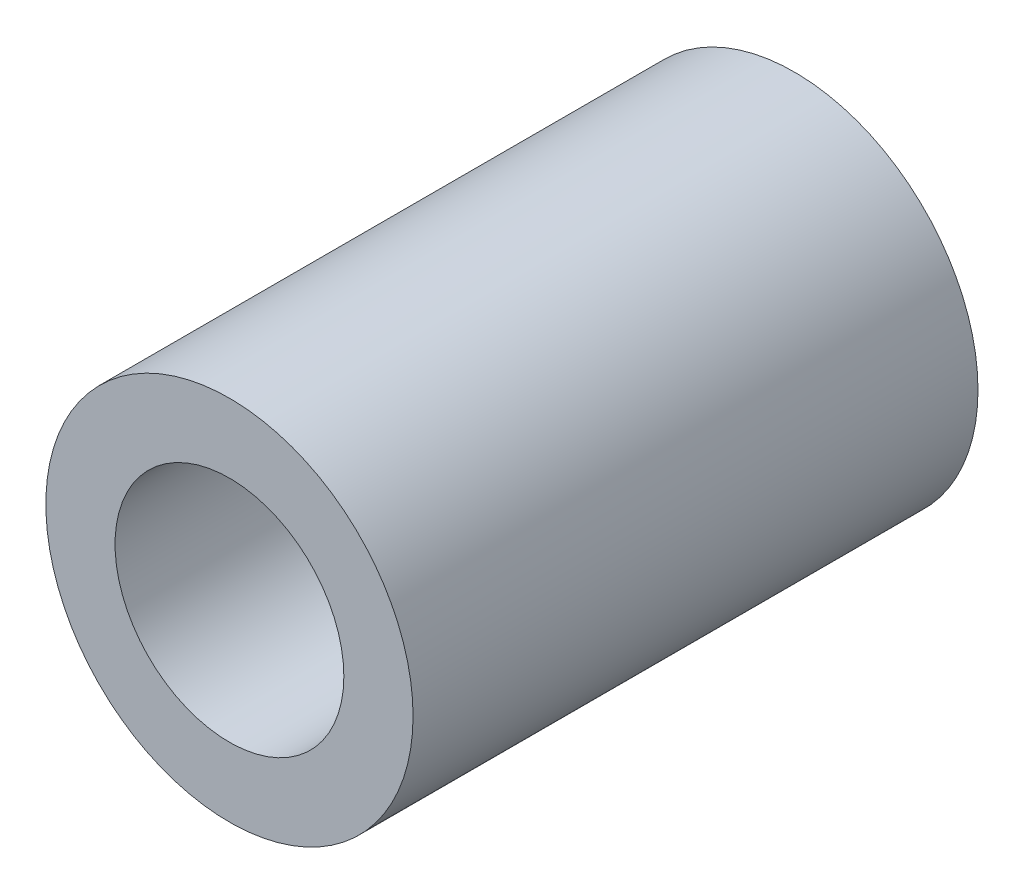
ISO-10303-21;
HEADER;
FILE_DESCRIPTION(('STEP AP214'),'2;1');
FILE_NAME('part.step','',(''),(''),'','','');
FILE_SCHEMA(('AUTOMOTIVE_DESIGN { 1 0 10303 214 1 1 1 1 }'));
ENDSEC;
DATA;
#1=APPLICATION_CONTEXT('core data for automotive mechanical design processes');
#2=APPLICATION_PROTOCOL_DEFINITION('international standard','automotive_design',2000,#1);
#3=PRODUCT_CONTEXT('',#1,'mechanical');
#4=PRODUCT('Part','Part','',(#3));
#5=PRODUCT_RELATED_PRODUCT_CATEGORY('part','',(#4));
#6=PRODUCT_DEFINITION_FORMATION('','',#4);
#7=PRODUCT_DEFINITION_CONTEXT('part definition',#1,'design');
#8=PRODUCT_DEFINITION('design','',#6,#7);
#9=PRODUCT_DEFINITION_SHAPE('','',#8);
#10=(LENGTH_UNIT() NAMED_UNIT(*) SI_UNIT(.MILLI.,.METRE.));
#11=(NAMED_UNIT(*) PLANE_ANGLE_UNIT() SI_UNIT($,.RADIAN.));
#12=(NAMED_UNIT(*) SI_UNIT($,.STERADIAN.) SOLID_ANGLE_UNIT());
#13=UNCERTAINTY_MEASURE_WITH_UNIT(LENGTH_MEASURE(1.E-05),#10,'distance_accuracy_value','');
#14=(GEOMETRIC_REPRESENTATION_CONTEXT(3) GLOBAL_UNCERTAINTY_ASSIGNED_CONTEXT((#13)) GLOBAL_UNIT_ASSIGNED_CONTEXT((#10,
#11,#12)) REPRESENTATION_CONTEXT('',''));
#15=CARTESIAN_POINT('',(0.,0.,0.));
#16=DIRECTION('',(0.,0.,1.));
#17=DIRECTION('',(1.,0.,0.));
#18=AXIS2_PLACEMENT_3D('',#15,#16,#17);
#19=CARTESIAN_POINT('',(0.,0.,20.));
#20=DIRECTION('',(0.,0.,1.));
#21=DIRECTION('',(1.,0.,0.));
#22=AXIS2_PLACEMENT_3D('',#19,#20,#21);
#23=PLANE('',#22);
#24=CARTESIAN_POINT('',(0.,0.,20.));
#25=DIRECTION('',(0.,0.,1.));
#26=DIRECTION('',(1.,0.,0.));
#27=AXIS2_PLACEMENT_3D('',#24,#25,#26);
#28=CIRCLE('',#27,6.5);
#29=CARTESIAN_POINT('',(6.5,0.,20.));
#30=VERTEX_POINT('',#29);
#31=EDGE_CURVE('E10',#30,#30,#28,.T.);
#32=ORIENTED_EDGE('',*,*,#31,.T.);
#33=EDGE_LOOP('',(#32));
#34=FACE_BOUND('',#33,.T.);
#35=CARTESIAN_POINT('',(0.,0.,20.));
#36=DIRECTION('',(0.,0.,1.));
#37=DIRECTION('',(1.,0.,0.));
#38=AXIS2_PLACEMENT_3D('',#35,#36,#37);
#39=CIRCLE('',#38,4.05);
#40=CARTESIAN_POINT('',(4.05,0.,20.));
#41=VERTEX_POINT('',#40);
#42=EDGE_CURVE('E48',#41,#41,#39,.T.);
#43=ORIENTED_EDGE('',*,*,#42,.F.);
#44=EDGE_LOOP('',(#43));
#45=FACE_BOUND('',#44,.T.);
#46=ADVANCED_FACE('F37',(#34,#45),#23,.T.);
#47=CARTESIAN_POINT('',(0.,0.,0.));
#48=DIRECTION('',(0.,0.,1.));
#49=DIRECTION('',(1.,0.,0.));
#50=AXIS2_PLACEMENT_3D('',#47,#48,#49);
#51=PLANE('',#50);
#52=CARTESIAN_POINT('',(0.,0.,0.));
#53=DIRECTION('',(0.,0.,1.));
#54=DIRECTION('',(1.,0.,0.));
#55=AXIS2_PLACEMENT_3D('',#52,#53,#54);
#56=CIRCLE('',#55,6.5);
#57=CARTESIAN_POINT('',(6.5,0.,0.));
#58=VERTEX_POINT('',#57);
#59=EDGE_CURVE('E41',#58,#58,#56,.T.);
#60=ORIENTED_EDGE('',*,*,#59,.F.);
#61=EDGE_LOOP('',(#60));
#62=FACE_BOUND('',#61,.T.);
#63=CARTESIAN_POINT('',(0.,0.,0.));
#64=DIRECTION('',(0.,0.,1.));
#65=DIRECTION('',(1.,0.,0.));
#66=AXIS2_PLACEMENT_3D('',#63,#64,#65);
#67=CIRCLE('',#66,4.05);
#68=CARTESIAN_POINT('',(4.05,0.,0.));
#69=VERTEX_POINT('',#68);
#70=EDGE_CURVE('E50',#69,#69,#67,.T.);
#71=ORIENTED_EDGE('',*,*,#70,.T.);
#72=EDGE_LOOP('',(#71));
#73=FACE_BOUND('',#72,.T.);
#74=ADVANCED_FACE('F60',(#62,#73),#51,.F.);
#75=CARTESIAN_POINT('',(0.,0.,20.));
#76=DIRECTION('',(0.,0.,-1.));
#77=DIRECTION('',(-1.,0.,0.));
#78=AXIS2_PLACEMENT_3D('',#75,#76,#77);
#79=CYLINDRICAL_SURFACE('',#78,6.5);
#80=ORIENTED_EDGE('',*,*,#31,.F.);
#81=EDGE_LOOP('',(#80));
#82=FACE_BOUND('',#81,.T.);
#83=ORIENTED_EDGE('',*,*,#59,.T.);
#84=EDGE_LOOP('',(#83));
#85=FACE_BOUND('',#84,.T.);
#86=ADVANCED_FACE('F39',(#82,#85),#79,.T.);
#87=CARTESIAN_POINT('',(0.,0.,20.));
#88=DIRECTION('',(0.,0.,-1.));
#89=DIRECTION('',(-1.,0.,0.));
#90=AXIS2_PLACEMENT_3D('',#87,#88,#89);
#91=CYLINDRICAL_SURFACE('',#90,4.05);
#92=ORIENTED_EDGE('',*,*,#42,.T.);
#93=EDGE_LOOP('',(#92));
#94=FACE_BOUND('',#93,.T.);
#95=ORIENTED_EDGE('',*,*,#70,.F.);
#96=EDGE_LOOP('',(#95));
#97=FACE_BOUND('',#96,.T.);
#98=ADVANCED_FACE('F56',(#94,#97),#91,.F.);
#99=CLOSED_SHELL('',(#46,#74,#86,#98));
#100=MANIFOLD_SOLID_BREP('B2',#99);
#101=ADVANCED_BREP_SHAPE_REPRESENTATION('',(#18,#100),#14);
#102=SHAPE_DEFINITION_REPRESENTATION(#9,#101);
ENDSEC;
END-ISO-10303-21;
